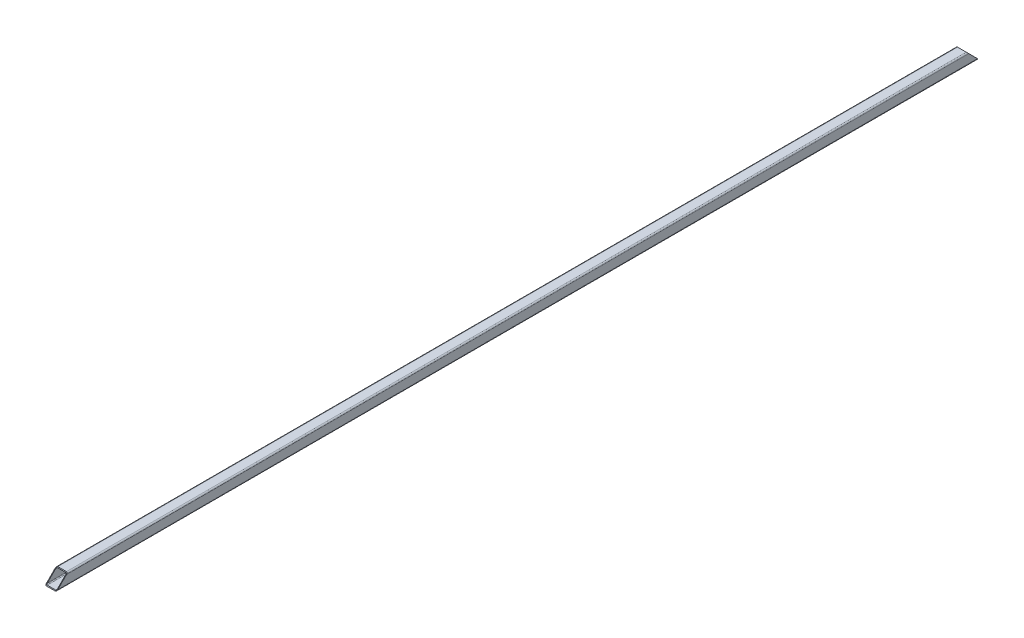
ISO-10303-21;
HEADER;
FILE_DESCRIPTION(('STEP AP214'),'2;1');
FILE_NAME('part.step','',(''),(''),'','','');
FILE_SCHEMA(('AUTOMOTIVE_DESIGN { 1 0 10303 214 1 1 1 1 }'));
ENDSEC;
DATA;
#1=APPLICATION_CONTEXT('core data for automotive mechanical design processes');
#2=APPLICATION_PROTOCOL_DEFINITION('international standard','automotive_design',2000,#1);
#3=PRODUCT_CONTEXT('',#1,'mechanical');
#4=PRODUCT('Part','Part','',(#3));
#5=PRODUCT_RELATED_PRODUCT_CATEGORY('part','',(#4));
#6=PRODUCT_DEFINITION_FORMATION('','',#4);
#7=PRODUCT_DEFINITION_CONTEXT('part definition',#1,'design');
#8=PRODUCT_DEFINITION('design','',#6,#7);
#9=PRODUCT_DEFINITION_SHAPE('','',#8);
#10=(LENGTH_UNIT() NAMED_UNIT(*) SI_UNIT(.MILLI.,.METRE.));
#11=(NAMED_UNIT(*) PLANE_ANGLE_UNIT() SI_UNIT($,.RADIAN.));
#12=(NAMED_UNIT(*) SI_UNIT($,.STERADIAN.) SOLID_ANGLE_UNIT());
#13=UNCERTAINTY_MEASURE_WITH_UNIT(LENGTH_MEASURE(1.E-05),#10,'distance_accuracy_value','');
#14=(GEOMETRIC_REPRESENTATION_CONTEXT(3) GLOBAL_UNCERTAINTY_ASSIGNED_CONTEXT((#13)) GLOBAL_UNIT_ASSIGNED_CONTEXT((#10,
#11,#12)) REPRESENTATION_CONTEXT('',''));
#15=CARTESIAN_POINT('',(0.,0.,0.));
#16=DIRECTION('',(0.,0.,1.));
#17=DIRECTION('',(1.,0.,0.));
#18=AXIS2_PLACEMENT_3D('',#15,#16,#17);
#19=CARTESIAN_POINT('',(-15.4999999999959,20.,-3239.99999999997));
#20=DIRECTION('',(0.,-1.,0.));
#21=DIRECTION('',(0.,0.,-0.999999999999992));
#22=AXIS2_PLACEMENT_3D('',#19,#20,#21);
#23=PLANE('',#22);
#24=DIRECTION('',(-1.,0.,0.));
#25=VECTOR('',#24,1.);
#26=CARTESIAN_POINT('',(-15.5000000000083,20.0000000000029,-20.));
#27=LINE('',#26,#25);
#28=CARTESIAN_POINT('',(15.4999999999923,20.0000000000022,-20.));
#29=VERTEX_POINT('',#28);
#30=CARTESIAN_POINT('',(-15.5000000000083,20.0000000000029,-19.9999999999991));
#31=VERTEX_POINT('',#30);
#32=EDGE_CURVE('E306',#29,#31,#27,.T.);
#33=ORIENTED_EDGE('',*,*,#32,.F.);
#34=DIRECTION('',(0.,0.,0.999999999999992));
#35=VECTOR('',#34,1.);
#36=CARTESIAN_POINT('',(15.5000000000043,19.9999999999978,-3239.99999999997));
#37=LINE('',#36,#35);
#38=CARTESIAN_POINT('',(15.4999999999998,19.9999999999996,-3219.99999999997));
#39=VERTEX_POINT('',#38);
#40=EDGE_CURVE('E260',#39,#29,#37,.T.);
#41=ORIENTED_EDGE('',*,*,#40,.F.);
#42=DIRECTION('',(1.,0.,0.));
#43=VECTOR('',#42,1.);
#44=CARTESIAN_POINT('',(-15.4999999999998,19.9999999999996,-3219.99999999997));
#45=LINE('',#44,#43);
#46=CARTESIAN_POINT('',(-15.4999999999998,19.9999999999996,-3219.99999999997));
#47=VERTEX_POINT('',#46);
#48=EDGE_CURVE('E361',#47,#39,#45,.T.);
#49=ORIENTED_EDGE('',*,*,#48,.F.);
#50=DIRECTION('',(0.,0.,0.999999999999992));
#51=VECTOR('',#50,1.);
#52=CARTESIAN_POINT('',(-15.4999999999959,20.,-3239.99999999997));
#53=LINE('',#52,#51);
#54=EDGE_CURVE('E263',#47,#31,#53,.T.);
#55=ORIENTED_EDGE('',*,*,#54,.T.);
#56=EDGE_LOOP('',(#33,#41,#49,#55));
#57=FACE_BOUND('',#56,.T.);
#58=ADVANCED_FACE('F47',(#57),#23,.F.);
#59=CARTESIAN_POINT('',(0.,0.,0.));
#60=DIRECTION('',(0.,0.707106781186548,0.707106781186539));
#61=DIRECTION('',(0.,-0.707106781186547,0.707106781186539));
#62=AXIS2_PLACEMENT_3D('',#59,#60,#61);
#63=PLANE('',#62);
#64=DIRECTION('',(0.,-0.707106781186547,0.707106781186539));
#65=VECTOR('',#64,1.);
#66=CARTESIAN_POINT('',(-18.0000000000042,1612.5,-1612.49999999998));
#67=LINE('',#66,#65);
#68=CARTESIAN_POINT('',(-18.0000000000078,14.9999999999999,-14.9999999999972));
#69=VERTEX_POINT('',#68);
#70=CARTESIAN_POINT('',(-17.9999999999985,-14.9999999999979,15.0000000000057));
#71=VERTEX_POINT('',#70);
#72=EDGE_CURVE('E189',#69,#71,#67,.T.);
#73=ORIENTED_EDGE('',*,*,#72,.F.);
#74=CARTESIAN_POINT('',(-15.0000000000086,14.9999999999999,-14.9999999999972));
#75=DIRECTION('',(0.,0.707106781186548,0.707106781186539));
#76=DIRECTION('',(0.,-0.707106781186547,0.707106781186539));
#77=AXIS2_PLACEMENT_3D('',#74,#75,#76);
#78=ELLIPSE('',#77,4.24264068711928,3.);
#79=CARTESIAN_POINT('',(-15.0000000000077,18.0000000000022,-17.9999999999971));
#80=VERTEX_POINT('',#79);
#81=EDGE_CURVE('E204',#80,#69,#78,.T.);
#82=ORIENTED_EDGE('',*,*,#81,.F.);
#83=DIRECTION('',(-1.,0.,0.));
#84=VECTOR('',#83,1.);
#85=CARTESIAN_POINT('',(-15.0000000000077,18.0000000000022,-17.9999999999971));
#86=LINE('',#85,#84);
#87=CARTESIAN_POINT('',(14.9999999999917,18.0000000000022,-17.9999999999971));
#88=VERTEX_POINT('',#87);
#89=EDGE_CURVE('E286',#88,#80,#86,.T.);
#90=ORIENTED_EDGE('',*,*,#89,.F.);
#91=CARTESIAN_POINT('',(14.9999999999917,14.9999999999999,-14.9999999999948));
#92=DIRECTION('',(0.,0.707106781186548,0.707106781186539));
#93=DIRECTION('',(0.,-0.707106781186547,0.707106781186539));
#94=AXIS2_PLACEMENT_3D('',#91,#92,#93);
#95=ELLIPSE('',#94,4.24264068711928,3.);
#96=CARTESIAN_POINT('',(17.9999999999918,14.9999999999999,-14.999999999999));
#97=VERTEX_POINT('',#96);
#98=EDGE_CURVE('E291',#97,#88,#95,.T.);
#99=ORIENTED_EDGE('',*,*,#98,.F.);
#100=DIRECTION('',(0.,0.707106781186547,-0.707106781186539));
#101=VECTOR('',#100,1.);
#102=CARTESIAN_POINT('',(17.9999999999954,1612.5,-1612.49999999998));
#103=LINE('',#102,#101);
#104=CARTESIAN_POINT('',(18.000000000002,-15.0000000000021,15.000000000003));
#105=VERTEX_POINT('',#104);
#106=EDGE_CURVE('E526',#105,#97,#103,.T.);
#107=ORIENTED_EDGE('',*,*,#106,.F.);
#108=CARTESIAN_POINT('',(15.0000000000019,-14.9999999999979,15.000000000003));
#109=DIRECTION('',(0.,0.707106781186548,0.707106781186539));
#110=DIRECTION('',(0.,-0.707106781186547,0.707106781186539));
#111=AXIS2_PLACEMENT_3D('',#108,#109,#110);
#112=ELLIPSE('',#111,4.24264068711928,3.);
#113=CARTESIAN_POINT('',(14.9999999999983,-18.0000000000021,18.0000000000029));
#114=VERTEX_POINT('',#113);
#115=EDGE_CURVE('E524',#114,#105,#112,.T.);
#116=ORIENTED_EDGE('',*,*,#115,.F.);
#117=DIRECTION('',(1.,0.,0.));
#118=VECTOR('',#117,1.);
#119=CARTESIAN_POINT('',(-15.0000000000019,-18.0000000000017,18.0000000000029));
#120=LINE('',#119,#118);
#121=CARTESIAN_POINT('',(-15.0000000000019,-18.0000000000017,18.0000000000029));
#122=VERTEX_POINT('',#121);
#123=EDGE_CURVE('E76',#122,#114,#120,.T.);
#124=ORIENTED_EDGE('',*,*,#123,.F.);
#125=CARTESIAN_POINT('',(-14.9999999999983,-15.0000000000021,15.0000000000003));
#126=DIRECTION('',(0.,0.707106781186548,0.707106781186539));
#127=DIRECTION('',(0.,-0.707106781186547,0.707106781186539));
#128=AXIS2_PLACEMENT_3D('',#125,#126,#127);
#129=ELLIPSE('',#128,4.24264068711928,3.);
#130=EDGE_CURVE('E11',#71,#122,#129,.T.);
#131=ORIENTED_EDGE('',*,*,#130,.F.);
#132=EDGE_LOOP('',(#73,#82,#90,#99,#107,#116,#124,#131));
#133=FACE_BOUND('',#132,.T.);
#134=CARTESIAN_POINT('',(-15.4999999999998,-15.4999999999978,15.4999999999998));
#135=DIRECTION('',(0.,0.707106781186548,0.707106781186539));
#136=DIRECTION('',(0.,-0.707106781186547,0.707106781186539));
#137=AXIS2_PLACEMENT_3D('',#134,#135,#136);
#138=ELLIPSE('',#137,6.36396103067893,4.5);
#139=CARTESIAN_POINT('',(-19.9999999999994,-15.4999999999994,15.5000000000052));
#140=VERTEX_POINT('',#139);
#141=CARTESIAN_POINT('',(-15.4999999999945,-19.9999999999989,20.0000000000022));
#142=VERTEX_POINT('',#141);
#143=EDGE_CURVE('E203',#140,#142,#138,.T.);
#144=ORIENTED_EDGE('',*,*,#143,.T.);
#145=DIRECTION('',(1.,0.,0.));
#146=VECTOR('',#145,1.);
#147=CARTESIAN_POINT('',(-15.4999999999945,-19.9999999999989,20.0000000000031));
#148=LINE('',#147,#146);
#149=CARTESIAN_POINT('',(15.5000000000052,-20.0000000000002,20.0000000000022));
#150=VERTEX_POINT('',#149);
#151=EDGE_CURVE('E281',#142,#150,#148,.T.);
#152=ORIENTED_EDGE('',*,*,#151,.T.);
#153=CARTESIAN_POINT('',(15.5000000000003,-15.4999999999978,15.4999999999998));
#154=DIRECTION('',(0.,0.707106781186548,0.707106781186539));
#155=DIRECTION('',(0.,-0.707106781186547,0.707106781186539));
#156=AXIS2_PLACEMENT_3D('',#153,#154,#155);
#157=ELLIPSE('',#156,6.36396103067893,4.5);
#158=CARTESIAN_POINT('',(20.0000000000007,-15.4999999999978,15.5000000000027));
#159=VERTEX_POINT('',#158);
#160=EDGE_CURVE('E318',#150,#159,#157,.T.);
#161=ORIENTED_EDGE('',*,*,#160,.T.);
#162=DIRECTION('',(0.,0.707106781186547,-0.707106781186539));
#163=VECTOR('',#162,1.);
#164=CARTESIAN_POINT('',(20.,1612.24999999999,-1612.24999999998));
#165=LINE('',#164,#163);
#166=CARTESIAN_POINT('',(19.9999999999918,15.5000000000001,-15.4999999999994));
#167=VERTEX_POINT('',#166);
#168=EDGE_CURVE('E314',#159,#167,#165,.T.);
#169=ORIENTED_EDGE('',*,*,#168,.T.);
#170=CARTESIAN_POINT('',(15.4999999999954,15.4999999999978,-15.4999999999994));
#171=DIRECTION('',(0.,0.707106781186548,0.707106781186539));
#172=DIRECTION('',(0.,-0.707106781186547,0.707106781186539));
#173=AXIS2_PLACEMENT_3D('',#170,#171,#172);
#174=ELLIPSE('',#173,6.36396103067893,4.5);
#175=EDGE_CURVE('E310',#167,#29,#174,.T.);
#176=ORIENTED_EDGE('',*,*,#175,.T.);
#177=ORIENTED_EDGE('',*,*,#32,.T.);
#178=CARTESIAN_POINT('',(-15.5000000000047,15.4999999999978,-15.4999999999994));
#179=DIRECTION('',(0.,0.707106781186548,0.707106781186539));
#180=DIRECTION('',(0.,-0.707106781186547,0.707106781186539));
#181=AXIS2_PLACEMENT_3D('',#178,#179,#180);
#182=ELLIPSE('',#181,6.36396103067893,4.5);
#183=CARTESIAN_POINT('',(-20.0000000000073,15.4999999999998,-15.499999999997));
#184=VERTEX_POINT('',#183);
#185=EDGE_CURVE('E302',#31,#184,#182,.T.);
#186=ORIENTED_EDGE('',*,*,#185,.T.);
#187=DIRECTION('',(0.,-0.707106781186547,0.707106781186539));
#188=VECTOR('',#187,1.);
#189=CARTESIAN_POINT('',(-20.,1612.25,-1612.24999999998));
#190=LINE('',#189,#188);
#191=EDGE_CURVE('E298',#184,#140,#190,.T.);
#192=ORIENTED_EDGE('',*,*,#191,.T.);
#193=EDGE_LOOP('',(#144,#152,#161,#169,#176,#177,#186,#192));
#194=FACE_BOUND('',#193,.T.);
#195=ADVANCED_FACE('F187',(#133,#194),#63,.T.);
#196=CARTESIAN_POINT('',(15.4999999999998,-15.5000000000001,-3239.99999999998));
#197=DIRECTION('',(0.,0.,0.999999999999992));
#198=DIRECTION('',(1.,0.,0.));
#199=AXIS2_PLACEMENT_3D('',#196,#197,#198);
#200=CYLINDRICAL_SURFACE('',#199,4.5);
#201=ORIENTED_EDGE('',*,*,#160,.F.);
#202=DIRECTION('',(0.,0.,0.999999999999992));
#203=VECTOR('',#202,1.);
#204=CARTESIAN_POINT('',(15.5000000000056,-20.0000000000007,-3239.99999999997));
#205=LINE('',#204,#203);
#206=CARTESIAN_POINT('',(15.4999999999998,-19.9999999999987,-3259.99999999997));
#207=VERTEX_POINT('',#206);
#208=EDGE_CURVE('E248',#207,#150,#205,.T.);
#209=ORIENTED_EDGE('',*,*,#208,.F.);
#210=CARTESIAN_POINT('',(15.499999999991,-15.5000000000027,-3255.49999999996));
#211=DIRECTION('',(0.,0.707106781186547,-0.707106781186539));
#212=DIRECTION('',(0.,0.707106781186548,0.707106781186539));
#213=AXIS2_PLACEMENT_3D('',#210,#211,#212);
#214=ELLIPSE('',#213,6.36396103067893,4.5);
#215=CARTESIAN_POINT('',(19.9999999999911,-15.5000000000001,-3255.49999999997));
#216=VERTEX_POINT('',#215);
#217=EDGE_CURVE('E349',#216,#207,#214,.T.);
#218=ORIENTED_EDGE('',*,*,#217,.F.);
#219=DIRECTION('',(0.,0.,0.999999999999992));
#220=VECTOR('',#219,1.);
#221=CARTESIAN_POINT('',(20.,-15.5000000000001,-3239.99999999997));
#222=LINE('',#221,#220);
#223=EDGE_CURVE('E252',#216,#159,#222,.T.);
#224=ORIENTED_EDGE('',*,*,#223,.T.);
#225=EDGE_LOOP('',(#201,#209,#218,#224));
#226=FACE_BOUND('',#225,.T.);
#227=ADVANCED_FACE('F397',(#226),#200,.T.);
#228=CARTESIAN_POINT('',(20.,-15.5000000000001,-3239.99999999997));
#229=DIRECTION('',(-1.,0.,0.));
#230=DIRECTION('',(0.,0.,0.999999999999992));
#231=AXIS2_PLACEMENT_3D('',#228,#229,#230);
#232=PLANE('',#231);
#233=ORIENTED_EDGE('',*,*,#168,.F.);
#234=ORIENTED_EDGE('',*,*,#223,.F.);
#235=DIRECTION('',(0.,-0.707106781186548,-0.707106781186539));
#236=VECTOR('',#235,1.);
#237=CARTESIAN_POINT('',(19.9999999999956,-7.75000000000037,-3247.74999999997));
#238=LINE('',#237,#236);
#239=CARTESIAN_POINT('',(20.,15.4999999999978,-3224.49999999997));
#240=VERTEX_POINT('',#239);
#241=EDGE_CURVE('E353',#240,#216,#238,.T.);
#242=ORIENTED_EDGE('',*,*,#241,.F.);
#243=DIRECTION('',(0.,0.,0.999999999999992));
#244=VECTOR('',#243,1.);
#245=CARTESIAN_POINT('',(20.0000000000045,15.4999999999998,-3239.99999999997));
#246=LINE('',#245,#244);
#247=EDGE_CURVE('E256',#240,#167,#246,.T.);
#248=ORIENTED_EDGE('',*,*,#247,.T.);
#249=EDGE_LOOP('',(#233,#234,#242,#248));
#250=FACE_BOUND('',#249,.T.);
#251=ADVANCED_FACE('F394',(#250),#232,.F.);
#252=CARTESIAN_POINT('',(15.5000000000043,15.5000000000001,-3239.99999999997));
#253=DIRECTION('',(0.,0.,0.999999999999992));
#254=DIRECTION('',(1.,0.,0.));
#255=AXIS2_PLACEMENT_3D('',#252,#253,#254);
#256=CYLINDRICAL_SURFACE('',#255,4.5);
#257=ORIENTED_EDGE('',*,*,#175,.F.);
#258=ORIENTED_EDGE('',*,*,#247,.F.);
#259=CARTESIAN_POINT('',(15.4999999999998,15.4999999999998,-3224.49999999997));
#260=DIRECTION('',(0.,0.707106781186547,-0.707106781186539));
#261=DIRECTION('',(0.,0.707106781186548,0.707106781186539));
#262=AXIS2_PLACEMENT_3D('',#259,#260,#261);
#263=ELLIPSE('',#262,6.36396103067893,4.5);
#264=EDGE_CURVE('E357',#39,#240,#263,.T.);
#265=ORIENTED_EDGE('',*,*,#264,.F.);
#266=ORIENTED_EDGE('',*,*,#40,.T.);
#267=EDGE_LOOP('',(#257,#258,#265,#266));
#268=FACE_BOUND('',#267,.T.);
#269=ADVANCED_FACE('F391',(#268),#256,.T.);
#270=CARTESIAN_POINT('',(-15.4999999999959,15.5000000000001,-3239.99999999997));
#271=DIRECTION('',(0.,0.,0.999999999999992));
#272=DIRECTION('',(1.,0.,0.));
#273=AXIS2_PLACEMENT_3D('',#270,#271,#272);
#274=CYLINDRICAL_SURFACE('',#273,4.5);
#275=ORIENTED_EDGE('',*,*,#185,.F.);
#276=ORIENTED_EDGE('',*,*,#54,.F.);
#277=CARTESIAN_POINT('',(-15.4999999999998,15.4999999999998,-3224.49999999997));
#278=DIRECTION('',(0.,0.707106781186547,-0.707106781186539));
#279=DIRECTION('',(0.,0.707106781186548,0.707106781186539));
#280=AXIS2_PLACEMENT_3D('',#277,#278,#279);
#281=ELLIPSE('',#280,6.36396103067893,4.5);
#282=CARTESIAN_POINT('',(-20.,15.4999999999994,-3224.49999999997));
#283=VERTEX_POINT('',#282);
#284=EDGE_CURVE('E365',#283,#47,#281,.T.);
#285=ORIENTED_EDGE('',*,*,#284,.F.);
#286=DIRECTION('',(0.,0.,0.999999999999992));
#287=VECTOR('',#286,1.);
#288=CARTESIAN_POINT('',(-19.9999999999956,15.5000000000001,-3239.99999999997));
#289=LINE('',#288,#287);
#290=EDGE_CURVE('E217',#283,#184,#289,.T.);
#291=ORIENTED_EDGE('',*,*,#290,.T.);
#292=EDGE_LOOP('',(#275,#276,#285,#291));
#293=FACE_BOUND('',#292,.T.);
#294=ADVANCED_FACE('F385',(#293),#274,.T.);
#295=CARTESIAN_POINT('',(-20.,-15.4999999999998,-3239.99999999997));
#296=DIRECTION('',(1.,0.,0.));
#297=DIRECTION('',(0.,0.,-0.999999999999992));
#298=AXIS2_PLACEMENT_3D('',#295,#296,#297);
#299=PLANE('',#298);
#300=ORIENTED_EDGE('',*,*,#191,.F.);
#301=ORIENTED_EDGE('',*,*,#290,.F.);
#302=DIRECTION('',(0.,0.707106781186548,0.707106781186539));
#303=VECTOR('',#302,1.);
#304=CARTESIAN_POINT('',(-20.000000000004,-7.75000000000214,-3247.74999999997));
#305=LINE('',#304,#303);
#306=CARTESIAN_POINT('',(-20.0000000000089,-15.5000000000001,-3255.49999999997));
#307=VERTEX_POINT('',#306);
#308=EDGE_CURVE('E368',#307,#283,#305,.T.);
#309=ORIENTED_EDGE('',*,*,#308,.F.);
#310=DIRECTION('',(0.,0.,0.999999999999992));
#311=VECTOR('',#310,1.);
#312=CARTESIAN_POINT('',(-20.,-15.4999999999998,-3239.99999999997));
#313=LINE('',#312,#311);
#314=EDGE_CURVE('E65',#307,#140,#313,.T.);
#315=ORIENTED_EDGE('',*,*,#314,.T.);
#316=EDGE_LOOP('',(#300,#301,#309,#315));
#317=FACE_BOUND('',#316,.T.);
#318=ADVANCED_FACE('F383',(#317),#299,.F.);
#319=CARTESIAN_POINT('',(-15.4999999999998,-15.5000000000001,-3239.99999999997));
#320=DIRECTION('',(0.,0.,0.999999999999992));
#321=DIRECTION('',(1.,0.,0.));
#322=AXIS2_PLACEMENT_3D('',#319,#320,#321);
#323=CYLINDRICAL_SURFACE('',#322,4.5);
#324=ORIENTED_EDGE('',*,*,#143,.F.);
#325=ORIENTED_EDGE('',*,*,#314,.F.);
#326=CARTESIAN_POINT('',(-15.5000000000087,-15.5000000000021,-3255.49999999997));
#327=DIRECTION('',(0.,0.707106781186547,-0.707106781186539));
#328=DIRECTION('',(0.,0.707106781186548,0.707106781186539));
#329=AXIS2_PLACEMENT_3D('',#326,#327,#328);
#330=ELLIPSE('',#329,6.36396103067893,4.5);
#331=CARTESIAN_POINT('',(-15.5000000000003,-19.9999999999967,-3259.99999999998));
#332=VERTEX_POINT('',#331);
#333=EDGE_CURVE('E220',#332,#307,#330,.T.);
#334=ORIENTED_EDGE('',*,*,#333,.F.);
#335=DIRECTION('',(0.,0.,0.999999999999992));
#336=VECTOR('',#335,1.);
#337=CARTESIAN_POINT('',(-15.4999999999945,-19.9999999999985,-3239.99999999998));
#338=LINE('',#337,#336);
#339=EDGE_CURVE('E245',#332,#142,#338,.T.);
#340=ORIENTED_EDGE('',*,*,#339,.T.);
#341=EDGE_LOOP('',(#324,#325,#334,#340));
#342=FACE_BOUND('',#341,.T.);
#343=ADVANCED_FACE('F49',(#342),#323,.T.);
#344=CARTESIAN_POINT('',(-15.4999999999945,-19.9999999999985,-3239.99999999998));
#345=DIRECTION('',(0.,1.,0.));
#346=DIRECTION('',(0.,0.,0.999999999999992));
#347=AXIS2_PLACEMENT_3D('',#344,#345,#346);
#348=PLANE('',#347);
#349=ORIENTED_EDGE('',*,*,#151,.F.);
#350=ORIENTED_EDGE('',*,*,#339,.F.);
#351=DIRECTION('',(-1.,0.,0.));
#352=VECTOR('',#351,1.);
#353=CARTESIAN_POINT('',(-15.5000000000003,-19.9999999999967,-3259.99999999998));
#354=LINE('',#353,#352);
#355=EDGE_CURVE('E345',#207,#332,#354,.T.);
#356=ORIENTED_EDGE('',*,*,#355,.F.);
#357=ORIENTED_EDGE('',*,*,#208,.T.);
#358=EDGE_LOOP('',(#349,#350,#356,#357));
#359=FACE_BOUND('',#358,.T.);
#360=ADVANCED_FACE('F399',(#359),#348,.F.);
#361=CARTESIAN_POINT('',(-17.9999999999998,-15.0000000000021,-3239.99999999997));
#362=DIRECTION('',(1.,0.,0.));
#363=DIRECTION('',(0.,0.,-0.999999999999992));
#364=AXIS2_PLACEMENT_3D('',#361,#362,#363);
#365=PLANE('',#364);
#366=DIRECTION('',(0.,0.,0.999999999999992));
#367=VECTOR('',#366,1.);
#368=CARTESIAN_POINT('',(-17.9999999999958,14.9999999999979,-3239.99999999996));
#369=LINE('',#368,#367);
#370=CARTESIAN_POINT('',(-17.9999999999998,14.9999999999999,-3224.99999999996));
#371=VERTEX_POINT('',#370);
#372=EDGE_CURVE('E200',#371,#69,#369,.T.);
#373=ORIENTED_EDGE('',*,*,#372,.T.);
#374=ORIENTED_EDGE('',*,*,#72,.T.);
#375=DIRECTION('',(0.,0.,0.999999999999992));
#376=VECTOR('',#375,1.);
#377=CARTESIAN_POINT('',(-17.9999999999998,-15.0000000000021,-3239.99999999997));
#378=LINE('',#377,#376);
#379=CARTESIAN_POINT('',(-17.9999999999998,-14.9999999999999,-3254.99999999997));
#380=VERTEX_POINT('',#379);
#381=EDGE_CURVE('E198',#380,#71,#378,.T.);
#382=ORIENTED_EDGE('',*,*,#381,.F.);
#383=DIRECTION('',(0.,0.707106781186548,0.707106781186539));
#384=VECTOR('',#383,1.);
#385=CARTESIAN_POINT('',(-18.0000000000011,-7.50000000000051,-3247.49999999997));
#386=LINE('',#385,#384);
#387=EDGE_CURVE('E56',#380,#371,#386,.T.);
#388=ORIENTED_EDGE('',*,*,#387,.T.);
#389=EDGE_LOOP('',(#373,#374,#382,#388));
#390=FACE_BOUND('',#389,.T.);
#391=ADVANCED_FACE('F196',(#390),#365,.T.);
#392=CARTESIAN_POINT('',(-14.9999999999957,14.9999999999979,-3239.99999999997));
#393=DIRECTION('',(0.,0.,0.999999999999992));
#394=DIRECTION('',(1.,0.,0.));
#395=AXIS2_PLACEMENT_3D('',#392,#393,#394);
#396=CYLINDRICAL_SURFACE('',#395,3.);
#397=DIRECTION('',(0.,0.,0.999999999999992));
#398=VECTOR('',#397,1.);
#399=CARTESIAN_POINT('',(-14.9999999999957,17.9999999999978,-3239.99999999997));
#400=LINE('',#399,#398);
#401=CARTESIAN_POINT('',(-15.0000000000046,17.9999999999973,-3221.99999999997));
#402=VERTEX_POINT('',#401);
#403=EDGE_CURVE('E215',#402,#80,#400,.T.);
#404=ORIENTED_EDGE('',*,*,#403,.T.);
#405=ORIENTED_EDGE('',*,*,#81,.T.);
#406=ORIENTED_EDGE('',*,*,#372,.F.);
#407=CARTESIAN_POINT('',(-15.0000000000001,14.9999999999979,-3224.99999999997));
#408=DIRECTION('',(0.,0.707106781186547,-0.707106781186539));
#409=DIRECTION('',(0.,0.707106781186548,0.707106781186539));
#410=AXIS2_PLACEMENT_3D('',#407,#408,#409);
#411=ELLIPSE('',#410,4.24264068711928,3.);
#412=EDGE_CURVE('E275',#371,#402,#411,.T.);
#413=ORIENTED_EDGE('',*,*,#412,.T.);
#414=EDGE_LOOP('',(#404,#405,#406,#413));
#415=FACE_BOUND('',#414,.T.);
#416=ADVANCED_FACE('F283',(#415),#396,.F.);
#417=CARTESIAN_POINT('',(-14.9999999999957,17.9999999999978,-3239.99999999997));
#418=DIRECTION('',(0.,-1.,0.));
#419=DIRECTION('',(0.,0.,-0.999999999999992));
#420=AXIS2_PLACEMENT_3D('',#417,#418,#419);
#421=PLANE('',#420);
#422=DIRECTION('',(0.,0.,0.999999999999992));
#423=VECTOR('',#422,1.);
#424=CARTESIAN_POINT('',(15.0000000000041,17.9999999999978,-3239.99999999997));
#425=LINE('',#424,#423);
#426=CARTESIAN_POINT('',(14.9999999999957,18.,-3221.99999999997));
#427=VERTEX_POINT('',#426);
#428=EDGE_CURVE('E226',#427,#88,#425,.T.);
#429=ORIENTED_EDGE('',*,*,#428,.T.);
#430=ORIENTED_EDGE('',*,*,#89,.T.);
#431=ORIENTED_EDGE('',*,*,#403,.F.);
#432=DIRECTION('',(1.,0.,0.));
#433=VECTOR('',#432,1.);
#434=CARTESIAN_POINT('',(-15.0000000000046,17.9999999999973,-3221.99999999997));
#435=LINE('',#434,#433);
#436=EDGE_CURVE('E277',#402,#427,#435,.T.);
#437=ORIENTED_EDGE('',*,*,#436,.T.);
#438=EDGE_LOOP('',(#429,#430,#431,#437));
#439=FACE_BOUND('',#438,.T.);
#440=ADVANCED_FACE('F447',(#439),#421,.T.);
#441=CARTESIAN_POINT('',(15.0000000000041,14.9999999999979,-3239.99999999997));
#442=DIRECTION('',(0.,0.,0.999999999999992));
#443=DIRECTION('',(1.,0.,0.));
#444=AXIS2_PLACEMENT_3D('',#441,#442,#443);
#445=CYLINDRICAL_SURFACE('',#444,3.);
#446=DIRECTION('',(0.,0.,0.999999999999992));
#447=VECTOR('',#446,1.);
#448=CARTESIAN_POINT('',(18.0000000000042,14.999999999998,-3239.99999999997));
#449=LINE('',#448,#447);
#450=CARTESIAN_POINT('',(18.0000000000002,15.0000000000001,-3224.99999999997));
#451=VERTEX_POINT('',#450);
#452=EDGE_CURVE('E230',#451,#97,#449,.T.);
#453=ORIENTED_EDGE('',*,*,#452,.T.);
#454=ORIENTED_EDGE('',*,*,#98,.T.);
#455=ORIENTED_EDGE('',*,*,#428,.F.);
#456=CARTESIAN_POINT('',(15.0000000000001,14.9999999999999,-3224.99999999996));
#457=DIRECTION('',(0.,0.707106781186547,-0.707106781186539));
#458=DIRECTION('',(0.,0.707106781186548,0.707106781186539));
#459=AXIS2_PLACEMENT_3D('',#456,#457,#458);
#460=ELLIPSE('',#459,4.24264068711928,3.);
#461=EDGE_CURVE('E327',#427,#451,#460,.T.);
#462=ORIENTED_EDGE('',*,*,#461,.T.);
#463=EDGE_LOOP('',(#453,#454,#455,#462));
#464=FACE_BOUND('',#463,.T.);
#465=ADVANCED_FACE('F455',(#464),#445,.F.);
#466=CARTESIAN_POINT('',(18.0000000000002,-15.0000000000018,-3239.99999999997));
#467=DIRECTION('',(-1.,0.,0.));
#468=DIRECTION('',(0.,0.,0.999999999999992));
#469=AXIS2_PLACEMENT_3D('',#466,#467,#468);
#470=PLANE('',#469);
#471=DIRECTION('',(0.,0.,0.999999999999992));
#472=VECTOR('',#471,1.);
#473=CARTESIAN_POINT('',(18.0000000000002,-15.0000000000018,-3239.99999999997));
#474=LINE('',#473,#472);
#475=CARTESIAN_POINT('',(18.0000000000002,-14.9999999999999,-3254.99999999997));
#476=VERTEX_POINT('',#475);
#477=EDGE_CURVE('E234',#476,#105,#474,.T.);
#478=ORIENTED_EDGE('',*,*,#477,.T.);
#479=ORIENTED_EDGE('',*,*,#106,.T.);
#480=ORIENTED_EDGE('',*,*,#452,.F.);
#481=DIRECTION('',(0.,-0.707106781186548,-0.707106781186539));
#482=VECTOR('',#481,1.);
#483=CARTESIAN_POINT('',(17.9999999999989,-7.50000000000228,-3247.49999999998));
#484=LINE('',#483,#482);
#485=EDGE_CURVE('E331',#451,#476,#484,.T.);
#486=ORIENTED_EDGE('',*,*,#485,.T.);
#487=EDGE_LOOP('',(#478,#479,#480,#486));
#488=FACE_BOUND('',#487,.T.);
#489=ADVANCED_FACE('F463',(#488),#470,.T.);
#490=CARTESIAN_POINT('',(15.0000000000001,-15.0000000000021,-3239.99999999997));
#491=DIRECTION('',(0.,0.,0.999999999999992));
#492=DIRECTION('',(1.,0.,0.));
#493=AXIS2_PLACEMENT_3D('',#490,#491,#492);
#494=CYLINDRICAL_SURFACE('',#493,3.);
#495=DIRECTION('',(0.,0.,0.999999999999992));
#496=VECTOR('',#495,1.);
#497=CARTESIAN_POINT('',(15.0000000000001,-18.000000000003,-3239.99999999996));
#498=LINE('',#497,#496);
#499=CARTESIAN_POINT('',(14.9999999999957,-18.0000000000046,-3257.99999999997));
#500=VERTEX_POINT('',#499);
#501=EDGE_CURVE('E238',#500,#114,#498,.T.);
#502=ORIENTED_EDGE('',*,*,#501,.T.);
#503=ORIENTED_EDGE('',*,*,#115,.T.);
#504=ORIENTED_EDGE('',*,*,#477,.F.);
#505=CARTESIAN_POINT('',(15.0000000000001,-14.9999999999999,-3254.99999999996));
#506=DIRECTION('',(0.,0.707106781186547,-0.707106781186539));
#507=DIRECTION('',(0.,0.707106781186548,0.707106781186539));
#508=AXIS2_PLACEMENT_3D('',#505,#506,#507);
#509=ELLIPSE('',#508,4.24264068711928,3.);
#510=EDGE_CURVE('E335',#476,#500,#509,.T.);
#511=ORIENTED_EDGE('',*,*,#510,.T.);
#512=EDGE_LOOP('',(#502,#503,#504,#511));
#513=FACE_BOUND('',#512,.T.);
#514=ADVANCED_FACE('F471',(#513),#494,.F.);
#515=CARTESIAN_POINT('',(-15.0000000000001,-18.0000000000017,-3239.99999999997));
#516=DIRECTION('',(0.,1.,0.));
#517=DIRECTION('',(0.,0.,0.999999999999992));
#518=AXIS2_PLACEMENT_3D('',#515,#516,#517);
#519=PLANE('',#518);
#520=DIRECTION('',(0.,0.,0.999999999999992));
#521=VECTOR('',#520,1.);
#522=CARTESIAN_POINT('',(-15.0000000000001,-18.0000000000017,-3239.99999999997));
#523=LINE('',#522,#521);
#524=CARTESIAN_POINT('',(-15.0000000000046,-17.9999999999999,-3257.99999999997));
#525=VERTEX_POINT('',#524);
#526=EDGE_CURVE('E242',#525,#122,#523,.T.);
#527=ORIENTED_EDGE('',*,*,#526,.T.);
#528=ORIENTED_EDGE('',*,*,#123,.T.);
#529=ORIENTED_EDGE('',*,*,#501,.F.);
#530=DIRECTION('',(-1.,0.,0.));
#531=VECTOR('',#530,1.);
#532=CARTESIAN_POINT('',(-15.0000000000046,-17.9999999999999,-3257.99999999997));
#533=LINE('',#532,#531);
#534=EDGE_CURVE('E339',#500,#525,#533,.T.);
#535=ORIENTED_EDGE('',*,*,#534,.T.);
#536=EDGE_LOOP('',(#527,#528,#529,#535));
#537=FACE_BOUND('',#536,.T.);
#538=ADVANCED_FACE('F479',(#537),#519,.T.);
#539=CARTESIAN_POINT('',(-15.0000000000001,-15.0000000000021,-3239.99999999997));
#540=DIRECTION('',(0.,0.,0.999999999999992));
#541=DIRECTION('',(1.,0.,0.));
#542=AXIS2_PLACEMENT_3D('',#539,#540,#541);
#543=CYLINDRICAL_SURFACE('',#542,3.);
#544=ORIENTED_EDGE('',*,*,#381,.T.);
#545=ORIENTED_EDGE('',*,*,#130,.T.);
#546=ORIENTED_EDGE('',*,*,#526,.F.);
#547=CARTESIAN_POINT('',(-15.0000000000001,-14.9999999999992,-3254.99999999996));
#548=DIRECTION('',(0.,0.707106781186547,-0.707106781186539));
#549=DIRECTION('',(0.,0.707106781186548,0.707106781186539));
#550=AXIS2_PLACEMENT_3D('',#547,#548,#549);
#551=ELLIPSE('',#550,4.24264068711928,3.);
#552=EDGE_CURVE('E208',#525,#380,#551,.T.);
#553=ORIENTED_EDGE('',*,*,#552,.T.);
#554=EDGE_LOOP('',(#544,#545,#546,#553));
#555=FACE_BOUND('',#554,.T.);
#556=ADVANCED_FACE('F207',(#555),#543,.F.);
#557=CARTESIAN_POINT('',(0.,0.,-3239.99999999996));
#558=DIRECTION('',(0.,0.707106781186547,-0.707106781186539));
#559=DIRECTION('',(0.,0.707106781186548,0.707106781186539));
#560=AXIS2_PLACEMENT_3D('',#557,#558,#559);
#561=PLANE('',#560);
#562=ORIENTED_EDGE('',*,*,#552,.F.);
#563=ORIENTED_EDGE('',*,*,#534,.F.);
#564=ORIENTED_EDGE('',*,*,#510,.F.);
#565=ORIENTED_EDGE('',*,*,#485,.F.);
#566=ORIENTED_EDGE('',*,*,#461,.F.);
#567=ORIENTED_EDGE('',*,*,#436,.F.);
#568=ORIENTED_EDGE('',*,*,#412,.F.);
#569=ORIENTED_EDGE('',*,*,#387,.F.);
#570=EDGE_LOOP('',(#562,#563,#564,#565,#566,#567,#568,#569));
#571=FACE_BOUND('',#570,.T.);
#572=ORIENTED_EDGE('',*,*,#355,.T.);
#573=ORIENTED_EDGE('',*,*,#333,.T.);
#574=ORIENTED_EDGE('',*,*,#308,.T.);
#575=ORIENTED_EDGE('',*,*,#284,.T.);
#576=ORIENTED_EDGE('',*,*,#48,.T.);
#577=ORIENTED_EDGE('',*,*,#264,.T.);
#578=ORIENTED_EDGE('',*,*,#241,.T.);
#579=ORIENTED_EDGE('',*,*,#217,.T.);
#580=EDGE_LOOP('',(#572,#573,#574,#575,#576,#577,#578,#579));
#581=FACE_BOUND('',#580,.T.);
#582=ADVANCED_FACE('F272',(#571,#581),#561,.T.);
#583=CLOSED_SHELL('',(#58,#195,#227,#251,#269,#294,#318,#343,#360,#391,#416,#440,#465,#489,#514,
#538,#556,#582));
#584=MANIFOLD_SOLID_BREP('B2',#583);
#585=ADVANCED_BREP_SHAPE_REPRESENTATION('',(#18,#584),#14);
#586=SHAPE_DEFINITION_REPRESENTATION(#9,#585);
ENDSEC;
END-ISO-10303-21;
